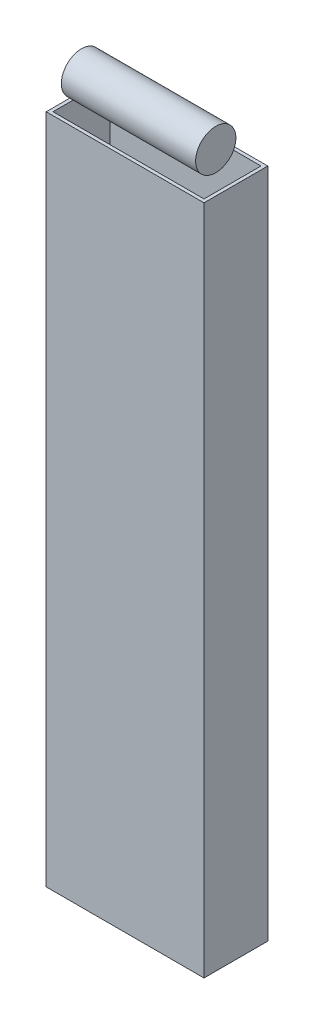
ISO-10303-21;
HEADER;
FILE_DESCRIPTION(('STEP AP214'),'2;1');
FILE_NAME('part.step','',(''),(''),'','','');
FILE_SCHEMA(('AUTOMOTIVE_DESIGN { 1 0 10303 214 1 1 1 1 }'));
ENDSEC;
DATA;
#1=APPLICATION_CONTEXT('core data for automotive mechanical design processes');
#2=APPLICATION_PROTOCOL_DEFINITION('international standard','automotive_design',2000,#1);
#3=PRODUCT_CONTEXT('',#1,'mechanical');
#4=PRODUCT('Part','Part','',(#3));
#5=PRODUCT_RELATED_PRODUCT_CATEGORY('part','',(#4));
#6=PRODUCT_DEFINITION_FORMATION('','',#4);
#7=PRODUCT_DEFINITION_CONTEXT('part definition',#1,'design');
#8=PRODUCT_DEFINITION('design','',#6,#7);
#9=PRODUCT_DEFINITION_SHAPE('','',#8);
#10=(LENGTH_UNIT() NAMED_UNIT(*) SI_UNIT(.MILLI.,.METRE.));
#11=(NAMED_UNIT(*) PLANE_ANGLE_UNIT() SI_UNIT($,.RADIAN.));
#12=(NAMED_UNIT(*) SI_UNIT($,.STERADIAN.) SOLID_ANGLE_UNIT());
#13=UNCERTAINTY_MEASURE_WITH_UNIT(LENGTH_MEASURE(1.E-05),#10,'distance_accuracy_value','');
#14=(GEOMETRIC_REPRESENTATION_CONTEXT(3) GLOBAL_UNCERTAINTY_ASSIGNED_CONTEXT((#13)) GLOBAL_UNIT_ASSIGNED_CONTEXT((#10,
#11,#12)) REPRESENTATION_CONTEXT('',''));
#15=CARTESIAN_POINT('',(0.,0.,0.));
#16=DIRECTION('',(0.,0.,1.));
#17=DIRECTION('',(1.,0.,0.));
#18=AXIS2_PLACEMENT_3D('',#15,#16,#17);
#19=CARTESIAN_POINT('',(17.5,206.,0.));
#20=DIRECTION('',(-1.,0.,0.));
#21=DIRECTION('',(0.,0.,1.));
#22=AXIS2_PLACEMENT_3D('',#19,#20,#21);
#23=CYLINDRICAL_SURFACE('',#22,6.00000000000001);
#24=CARTESIAN_POINT('',(17.5,206.,0.));
#25=DIRECTION('',(1.,0.,0.));
#26=DIRECTION('',(0.,0.,-1.));
#27=AXIS2_PLACEMENT_3D('',#24,#25,#26);
#28=CIRCLE('',#27,6.00000000000001);
#29=CARTESIAN_POINT('',(17.5,206.,-6.00000000000001));
#30=VERTEX_POINT('',#29);
#31=EDGE_CURVE('E11',#30,#30,#28,.T.);
#32=ORIENTED_EDGE('',*,*,#31,.F.);
#33=EDGE_LOOP('',(#32));
#34=FACE_BOUND('',#33,.T.);
#35=CARTESIAN_POINT('',(-22.5,206.,0.));
#36=DIRECTION('',(1.,0.,0.));
#37=DIRECTION('',(0.,0.,-1.));
#38=AXIS2_PLACEMENT_3D('',#35,#36,#37);
#39=CIRCLE('',#38,6.00000000000001);
#40=CARTESIAN_POINT('',(-22.5,206.,-6.00000000000001));
#41=VERTEX_POINT('',#40);
#42=EDGE_CURVE('E50',#41,#41,#39,.T.);
#43=ORIENTED_EDGE('',*,*,#42,.T.);
#44=EDGE_LOOP('',(#43));
#45=FACE_BOUND('',#44,.T.);
#46=ADVANCED_FACE('F47',(#34,#45),#23,.T.);
#47=CARTESIAN_POINT('',(17.5,206.,0.));
#48=DIRECTION('',(1.,0.,0.));
#49=DIRECTION('',(0.,0.,-1.));
#50=AXIS2_PLACEMENT_3D('',#47,#48,#49);
#51=PLANE('',#50);
#52=ORIENTED_EDGE('',*,*,#31,.T.);
#53=EDGE_LOOP('',(#52));
#54=FACE_BOUND('',#53,.T.);
#55=ADVANCED_FACE('F62',(#54),#51,.T.);
#56=CARTESIAN_POINT('',(-22.5,206.,0.));
#57=DIRECTION('',(1.,0.,0.));
#58=DIRECTION('',(0.,0.,-1.));
#59=AXIS2_PLACEMENT_3D('',#56,#57,#58);
#60=PLANE('',#59);
#61=ORIENTED_EDGE('',*,*,#42,.F.);
#62=EDGE_LOOP('',(#61));
#63=FACE_BOUND('',#62,.T.);
#64=ADVANCED_FACE('F60',(#63),#60,.F.);
#65=CLOSED_SHELL('',(#46,#55,#64));
#66=MANIFOLD_SOLID_BREP('B2',#65);
#67=CARTESIAN_POINT('',(0.,200.,0.));
#68=DIRECTION('',(0.,-1.,0.));
#69=DIRECTION('',(0.,0.,-1.));
#70=AXIS2_PLACEMENT_3D('',#67,#68,#69);
#71=PLANE('',#70);
#72=DIRECTION('',(0.,0.,-1.));
#73=VECTOR('',#72,1.);
#74=CARTESIAN_POINT('',(23.5,200.,9.5));
#75=LINE('',#74,#73);
#76=CARTESIAN_POINT('',(23.5,200.,9.5));
#77=VERTEX_POINT('',#76);
#78=CARTESIAN_POINT('',(23.5,200.,-9.5));
#79=VERTEX_POINT('',#78);
#80=EDGE_CURVE('E200',#77,#79,#75,.T.);
#81=ORIENTED_EDGE('',*,*,#80,.T.);
#82=DIRECTION('',(-1.,0.,0.));
#83=VECTOR('',#82,1.);
#84=CARTESIAN_POINT('',(-23.5,200.,-9.5));
#85=LINE('',#84,#83);
#86=CARTESIAN_POINT('',(-23.5,200.,-9.5));
#87=VERTEX_POINT('',#86);
#88=EDGE_CURVE('E203',#79,#87,#85,.T.);
#89=ORIENTED_EDGE('',*,*,#88,.T.);
#90=DIRECTION('',(0.,0.,1.));
#91=VECTOR('',#90,1.);
#92=CARTESIAN_POINT('',(-23.5,200.,9.5));
#93=LINE('',#92,#91);
#94=CARTESIAN_POINT('',(-23.5,200.,9.5));
#95=VERTEX_POINT('',#94);
#96=EDGE_CURVE('E206',#87,#95,#93,.T.);
#97=ORIENTED_EDGE('',*,*,#96,.T.);
#98=DIRECTION('',(1.,0.,0.));
#99=VECTOR('',#98,1.);
#100=CARTESIAN_POINT('',(-23.5,200.,9.5));
#101=LINE('',#100,#99);
#102=EDGE_CURVE('E208',#95,#77,#101,.T.);
#103=ORIENTED_EDGE('',*,*,#102,.T.);
#104=EDGE_LOOP('',(#81,#89,#97,#103));
#105=FACE_BOUND('',#104,.T.);
#106=DIRECTION('',(1.,0.,0.));
#107=VECTOR('',#106,1.);
#108=CARTESIAN_POINT('',(-22.5,200.,8.5));
#109=LINE('',#108,#107);
#110=CARTESIAN_POINT('',(-22.5,200.,8.5));
#111=VERTEX_POINT('',#110);
#112=CARTESIAN_POINT('',(22.5,200.,8.5));
#113=VERTEX_POINT('',#112);
#114=EDGE_CURVE('E163',#111,#113,#109,.T.);
#115=ORIENTED_EDGE('',*,*,#114,.F.);
#116=DIRECTION('',(0.,0.,1.));
#117=VECTOR('',#116,1.);
#118=CARTESIAN_POINT('',(-22.5,200.,8.5));
#119=LINE('',#118,#117);
#120=CARTESIAN_POINT('',(-22.5,200.,0.));
#121=VERTEX_POINT('',#120);
#122=EDGE_CURVE('E109',#121,#111,#119,.T.);
#123=ORIENTED_EDGE('',*,*,#122,.F.);
#124=CARTESIAN_POINT('',(-22.5,200.,-8.5));
#125=VERTEX_POINT('',#124);
#126=EDGE_CURVE('E187',#125,#121,#119,.T.);
#127=ORIENTED_EDGE('',*,*,#126,.F.);
#128=DIRECTION('',(-1.,0.,0.));
#129=VECTOR('',#128,1.);
#130=CARTESIAN_POINT('',(-22.5,200.,-8.5));
#131=LINE('',#130,#129);
#132=CARTESIAN_POINT('',(22.5,200.,-8.5));
#133=VERTEX_POINT('',#132);
#134=EDGE_CURVE('E183',#133,#125,#131,.T.);
#135=ORIENTED_EDGE('',*,*,#134,.F.);
#136=DIRECTION('',(0.,0.,-1.));
#137=VECTOR('',#136,1.);
#138=CARTESIAN_POINT('',(22.5,200.,8.5));
#139=LINE('',#138,#137);
#140=EDGE_CURVE('E171',#113,#133,#139,.T.);
#141=ORIENTED_EDGE('',*,*,#140,.F.);
#142=EDGE_LOOP('',(#115,#123,#127,#135,#141));
#143=FACE_BOUND('',#142,.T.);
#144=ADVANCED_FACE('F94',(#105,#143),#71,.F.);
#145=CARTESIAN_POINT('',(0.,0.,0.));
#146=DIRECTION('',(0.,-1.,0.));
#147=DIRECTION('',(0.,0.,-1.));
#148=AXIS2_PLACEMENT_3D('',#145,#146,#147);
#149=PLANE('',#148);
#150=DIRECTION('',(0.,0.,-1.));
#151=VECTOR('',#150,1.);
#152=CARTESIAN_POINT('',(23.5,0.,9.5));
#153=LINE('',#152,#151);
#154=CARTESIAN_POINT('',(23.5,0.,9.5));
#155=VERTEX_POINT('',#154);
#156=CARTESIAN_POINT('',(23.5,0.,-9.5));
#157=VERTEX_POINT('',#156);
#158=EDGE_CURVE('E179',#155,#157,#153,.T.);
#159=ORIENTED_EDGE('',*,*,#158,.F.);
#160=DIRECTION('',(1.,0.,0.));
#161=VECTOR('',#160,1.);
#162=CARTESIAN_POINT('',(-23.5,0.,9.5));
#163=LINE('',#162,#161);
#164=CARTESIAN_POINT('',(-23.5,0.,9.5));
#165=VERTEX_POINT('',#164);
#166=EDGE_CURVE('E204',#165,#155,#163,.T.);
#167=ORIENTED_EDGE('',*,*,#166,.F.);
#168=DIRECTION('',(0.,0.,1.));
#169=VECTOR('',#168,1.);
#170=CARTESIAN_POINT('',(-23.5,0.,9.5));
#171=LINE('',#170,#169);
#172=CARTESIAN_POINT('',(-23.5,0.,-9.5));
#173=VERTEX_POINT('',#172);
#174=EDGE_CURVE('E215',#173,#165,#171,.T.);
#175=ORIENTED_EDGE('',*,*,#174,.F.);
#176=DIRECTION('',(-1.,0.,0.));
#177=VECTOR('',#176,1.);
#178=CARTESIAN_POINT('',(-23.5,0.,-9.5));
#179=LINE('',#178,#177);
#180=EDGE_CURVE('E213',#157,#173,#179,.T.);
#181=ORIENTED_EDGE('',*,*,#180,.F.);
#182=EDGE_LOOP('',(#159,#167,#175,#181));
#183=FACE_BOUND('',#182,.T.);
#184=DIRECTION('',(0.,0.,1.));
#185=VECTOR('',#184,1.);
#186=CARTESIAN_POINT('',(-22.5,0.,8.5));
#187=LINE('',#186,#185);
#188=CARTESIAN_POINT('',(-22.5,0.,-8.5));
#189=VERTEX_POINT('',#188);
#190=CARTESIAN_POINT('',(-22.5,0.,8.5));
#191=VERTEX_POINT('',#190);
#192=EDGE_CURVE('E172',#189,#191,#187,.T.);
#193=ORIENTED_EDGE('',*,*,#192,.T.);
#194=DIRECTION('',(1.,0.,0.));
#195=VECTOR('',#194,1.);
#196=CARTESIAN_POINT('',(-22.5,0.,8.5));
#197=LINE('',#196,#195);
#198=CARTESIAN_POINT('',(22.5,0.,8.5));
#199=VERTEX_POINT('',#198);
#200=EDGE_CURVE('E189',#191,#199,#197,.T.);
#201=ORIENTED_EDGE('',*,*,#200,.T.);
#202=DIRECTION('',(0.,0.,-1.));
#203=VECTOR('',#202,1.);
#204=CARTESIAN_POINT('',(22.5,0.,8.5));
#205=LINE('',#204,#203);
#206=CARTESIAN_POINT('',(22.5,0.,-8.5));
#207=VERTEX_POINT('',#206);
#208=EDGE_CURVE('E178',#199,#207,#205,.T.);
#209=ORIENTED_EDGE('',*,*,#208,.T.);
#210=DIRECTION('',(-1.,0.,0.));
#211=VECTOR('',#210,1.);
#212=CARTESIAN_POINT('',(-22.5,0.,-8.5));
#213=LINE('',#212,#211);
#214=EDGE_CURVE('E192',#207,#189,#213,.T.);
#215=ORIENTED_EDGE('',*,*,#214,.T.);
#216=EDGE_LOOP('',(#193,#201,#209,#215));
#217=FACE_BOUND('',#216,.T.);
#218=ADVANCED_FACE('F233',(#183,#217),#149,.T.);
#219=CARTESIAN_POINT('',(23.5,200.,9.5));
#220=DIRECTION('',(-1.,0.,0.));
#221=DIRECTION('',(0.,0.,1.));
#222=AXIS2_PLACEMENT_3D('',#219,#220,#221);
#223=PLANE('',#222);
#224=ORIENTED_EDGE('',*,*,#158,.T.);
#225=DIRECTION('',(0.,-1.,0.));
#226=VECTOR('',#225,1.);
#227=CARTESIAN_POINT('',(23.5,200.,-9.5));
#228=LINE('',#227,#226);
#229=EDGE_CURVE('E45',#79,#157,#228,.T.);
#230=ORIENTED_EDGE('',*,*,#229,.F.);
#231=ORIENTED_EDGE('',*,*,#80,.F.);
#232=DIRECTION('',(0.,-1.,0.));
#233=VECTOR('',#232,1.);
#234=CARTESIAN_POINT('',(23.5,200.,9.5));
#235=LINE('',#234,#233);
#236=EDGE_CURVE('E210',#77,#155,#235,.T.);
#237=ORIENTED_EDGE('',*,*,#236,.T.);
#238=EDGE_LOOP('',(#224,#230,#231,#237));
#239=FACE_BOUND('',#238,.T.);
#240=ADVANCED_FACE('F96',(#239),#223,.F.);
#241=CARTESIAN_POINT('',(-23.5,200.,-9.5));
#242=DIRECTION('',(0.,0.,1.));
#243=DIRECTION('',(1.,0.,0.));
#244=AXIS2_PLACEMENT_3D('',#241,#242,#243);
#245=PLANE('',#244);
#246=ORIENTED_EDGE('',*,*,#180,.T.);
#247=DIRECTION('',(0.,-1.,0.));
#248=VECTOR('',#247,1.);
#249=CARTESIAN_POINT('',(-23.5,200.,-9.5));
#250=LINE('',#249,#248);
#251=EDGE_CURVE('E102',#87,#173,#250,.T.);
#252=ORIENTED_EDGE('',*,*,#251,.F.);
#253=ORIENTED_EDGE('',*,*,#88,.F.);
#254=ORIENTED_EDGE('',*,*,#229,.T.);
#255=EDGE_LOOP('',(#246,#252,#253,#254));
#256=FACE_BOUND('',#255,.T.);
#257=ADVANCED_FACE('F243',(#256),#245,.F.);
#258=CARTESIAN_POINT('',(-23.5,200.,9.5));
#259=DIRECTION('',(1.,0.,0.));
#260=DIRECTION('',(0.,0.,-1.));
#261=AXIS2_PLACEMENT_3D('',#258,#259,#260);
#262=PLANE('',#261);
#263=ORIENTED_EDGE('',*,*,#174,.T.);
#264=DIRECTION('',(0.,-1.,0.));
#265=VECTOR('',#264,1.);
#266=CARTESIAN_POINT('',(-23.5,200.,9.5));
#267=LINE('',#266,#265);
#268=EDGE_CURVE('E220',#95,#165,#267,.T.);
#269=ORIENTED_EDGE('',*,*,#268,.F.);
#270=ORIENTED_EDGE('',*,*,#96,.F.);
#271=ORIENTED_EDGE('',*,*,#251,.T.);
#272=EDGE_LOOP('',(#263,#269,#270,#271));
#273=FACE_BOUND('',#272,.T.);
#274=ADVANCED_FACE('F227',(#273),#262,.F.);
#275=CARTESIAN_POINT('',(-23.5,200.,9.5));
#276=DIRECTION('',(0.,0.,-1.));
#277=DIRECTION('',(-1.,0.,0.));
#278=AXIS2_PLACEMENT_3D('',#275,#276,#277);
#279=PLANE('',#278);
#280=ORIENTED_EDGE('',*,*,#166,.T.);
#281=ORIENTED_EDGE('',*,*,#236,.F.);
#282=ORIENTED_EDGE('',*,*,#102,.F.);
#283=ORIENTED_EDGE('',*,*,#268,.T.);
#284=EDGE_LOOP('',(#280,#281,#282,#283));
#285=FACE_BOUND('',#284,.T.);
#286=ADVANCED_FACE('F237',(#285),#279,.F.);
#287=CARTESIAN_POINT('',(-22.5,200.,8.5));
#288=DIRECTION('',(0.,0.,-1.));
#289=DIRECTION('',(-1.,0.,0.));
#290=AXIS2_PLACEMENT_3D('',#287,#288,#289);
#291=PLANE('',#290);
#292=ORIENTED_EDGE('',*,*,#200,.F.);
#293=DIRECTION('',(0.,-1.,0.));
#294=VECTOR('',#293,1.);
#295=CARTESIAN_POINT('',(-22.5,200.,8.5));
#296=LINE('',#295,#294);
#297=EDGE_CURVE('E169',#111,#191,#296,.T.);
#298=ORIENTED_EDGE('',*,*,#297,.F.);
#299=ORIENTED_EDGE('',*,*,#114,.T.);
#300=DIRECTION('',(0.,-1.,0.));
#301=VECTOR('',#300,1.);
#302=CARTESIAN_POINT('',(22.5,200.,8.5));
#303=LINE('',#302,#301);
#304=EDGE_CURVE('E166',#113,#199,#303,.T.);
#305=ORIENTED_EDGE('',*,*,#304,.T.);
#306=EDGE_LOOP('',(#292,#298,#299,#305));
#307=FACE_BOUND('',#306,.T.);
#308=ADVANCED_FACE('F165',(#307),#291,.T.);
#309=CARTESIAN_POINT('',(22.5,200.,8.5));
#310=DIRECTION('',(-1.,0.,0.));
#311=DIRECTION('',(0.,0.,1.));
#312=AXIS2_PLACEMENT_3D('',#309,#310,#311);
#313=PLANE('',#312);
#314=ORIENTED_EDGE('',*,*,#208,.F.);
#315=ORIENTED_EDGE('',*,*,#304,.F.);
#316=ORIENTED_EDGE('',*,*,#140,.T.);
#317=DIRECTION('',(0.,-1.,0.));
#318=VECTOR('',#317,1.);
#319=CARTESIAN_POINT('',(22.5,200.,-8.5));
#320=LINE('',#319,#318);
#321=EDGE_CURVE('E180',#133,#207,#320,.T.);
#322=ORIENTED_EDGE('',*,*,#321,.T.);
#323=EDGE_LOOP('',(#314,#315,#316,#322));
#324=FACE_BOUND('',#323,.T.);
#325=ADVANCED_FACE('F175',(#324),#313,.T.);
#326=CARTESIAN_POINT('',(-22.5,200.,-8.5));
#327=DIRECTION('',(0.,0.,1.));
#328=DIRECTION('',(1.,0.,0.));
#329=AXIS2_PLACEMENT_3D('',#326,#327,#328);
#330=PLANE('',#329);
#331=ORIENTED_EDGE('',*,*,#214,.F.);
#332=ORIENTED_EDGE('',*,*,#321,.F.);
#333=ORIENTED_EDGE('',*,*,#134,.T.);
#334=DIRECTION('',(0.,-1.,0.));
#335=VECTOR('',#334,1.);
#336=CARTESIAN_POINT('',(-22.5,200.,-8.5));
#337=LINE('',#336,#335);
#338=EDGE_CURVE('E116',#125,#189,#337,.T.);
#339=ORIENTED_EDGE('',*,*,#338,.T.);
#340=EDGE_LOOP('',(#331,#332,#333,#339));
#341=FACE_BOUND('',#340,.T.);
#342=ADVANCED_FACE('F266',(#341),#330,.T.);
#343=CARTESIAN_POINT('',(-22.5,200.,8.5));
#344=DIRECTION('',(1.,0.,0.));
#345=DIRECTION('',(0.,0.,-1.));
#346=AXIS2_PLACEMENT_3D('',#343,#344,#345);
#347=PLANE('',#346);
#348=ORIENTED_EDGE('',*,*,#192,.F.);
#349=ORIENTED_EDGE('',*,*,#338,.F.);
#350=ORIENTED_EDGE('',*,*,#126,.T.);
#351=ORIENTED_EDGE('',*,*,#122,.T.);
#352=ORIENTED_EDGE('',*,*,#297,.T.);
#353=EDGE_LOOP('',(#348,#349,#350,#351,#352));
#354=FACE_BOUND('',#353,.T.);
#355=ADVANCED_FACE('F270',(#354),#347,.T.);
#356=CLOSED_SHELL('',(#144,#218,#240,#257,#274,#286,#308,#325,#342,#355));
#357=MANIFOLD_SOLID_BREP('B6',#356);
#358=ADVANCED_BREP_SHAPE_REPRESENTATION('',(#18,#66,#357),#14);
#359=SHAPE_DEFINITION_REPRESENTATION(#9,#358);
ENDSEC;
END-ISO-10303-21;
